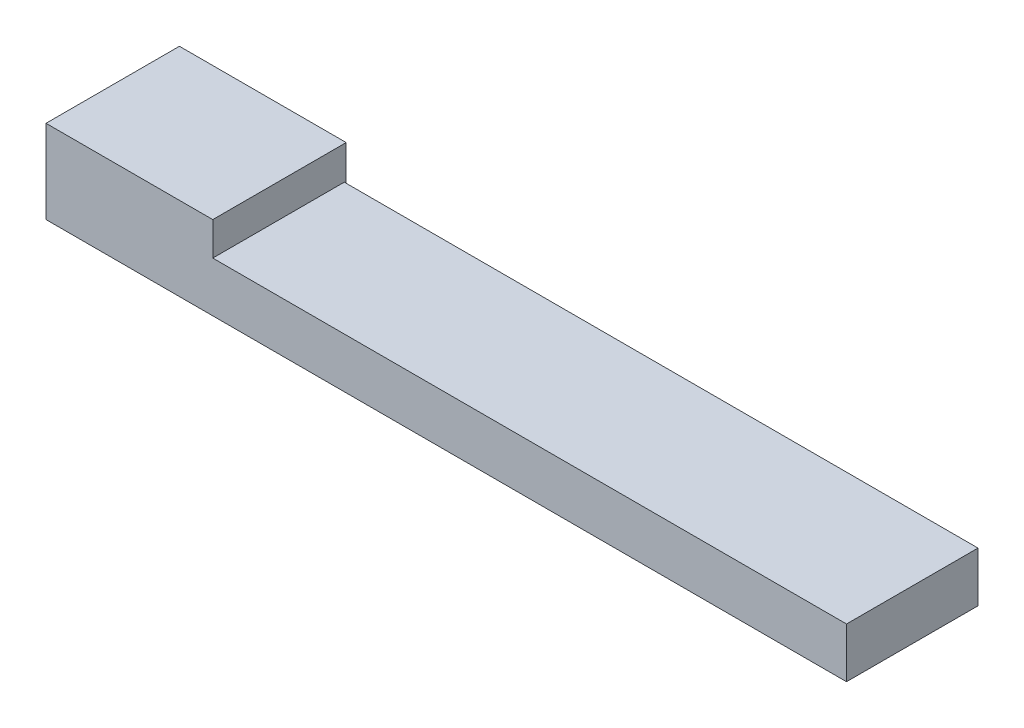
ISO-10303-21;
HEADER;
FILE_DESCRIPTION(('STEP AP214'),'2;1');
FILE_NAME('part.step','',(''),(''),'','','');
FILE_SCHEMA(('AUTOMOTIVE_DESIGN { 1 0 10303 214 1 1 1 1 }'));
ENDSEC;
DATA;
#1=APPLICATION_CONTEXT('core data for automotive mechanical design processes');
#2=APPLICATION_PROTOCOL_DEFINITION('international standard','automotive_design',2000,#1);
#3=PRODUCT_CONTEXT('',#1,'mechanical');
#4=PRODUCT('Part','Part','',(#3));
#5=PRODUCT_RELATED_PRODUCT_CATEGORY('part','',(#4));
#6=PRODUCT_DEFINITION_FORMATION('','',#4);
#7=PRODUCT_DEFINITION_CONTEXT('part definition',#1,'design');
#8=PRODUCT_DEFINITION('design','',#6,#7);
#9=PRODUCT_DEFINITION_SHAPE('','',#8);
#10=(LENGTH_UNIT() NAMED_UNIT(*) SI_UNIT(.MILLI.,.METRE.));
#11=(NAMED_UNIT(*) PLANE_ANGLE_UNIT() SI_UNIT($,.RADIAN.));
#12=(NAMED_UNIT(*) SI_UNIT($,.STERADIAN.) SOLID_ANGLE_UNIT());
#13=UNCERTAINTY_MEASURE_WITH_UNIT(LENGTH_MEASURE(1.E-05),#10,'distance_accuracy_value','');
#14=(GEOMETRIC_REPRESENTATION_CONTEXT(3) GLOBAL_UNCERTAINTY_ASSIGNED_CONTEXT((#13)) GLOBAL_UNIT_ASSIGNED_CONTEXT((#10,
#11,#12)) REPRESENTATION_CONTEXT('',''));
#15=CARTESIAN_POINT('',(0.,0.,0.));
#16=DIRECTION('',(0.,0.,1.));
#17=DIRECTION('',(1.,0.,0.));
#18=AXIS2_PLACEMENT_3D('',#15,#16,#17);
#19=CARTESIAN_POINT('',(-62.2244309443341,1524.,-2375.58992735266));
#20=DIRECTION('',(1.,0.,0.));
#21=DIRECTION('',(0.,0.,-1.));
#22=AXIS2_PLACEMENT_3D('',#19,#20,#21);
#23=PLANE('',#22);
#24=DIRECTION('',(0.,0.,1.));
#25=VECTOR('',#24,1.);
#26=CARTESIAN_POINT('',(-62.2244309443341,0.,-2375.58992735266));
#27=LINE('',#26,#25);
#28=CARTESIAN_POINT('',(-62.2244309443341,0.,-2375.58992735266));
#29=VERTEX_POINT('',#28);
#30=CARTESIAN_POINT('',(-62.2244309443338,0.,62.8100726473393));
#31=VERTEX_POINT('',#30);
#32=EDGE_CURVE('E133',#29,#31,#27,.T.);
#33=ORIENTED_EDGE('',*,*,#32,.T.);
#34=DIRECTION('',(0.,-1.,0.));
#35=VECTOR('',#34,1.);
#36=CARTESIAN_POINT('',(-62.2244309443338,1524.,62.8100726473393));
#37=LINE('',#36,#35);
#38=CARTESIAN_POINT('',(-62.2244309443338,1524.,62.8100726473393));
#39=VERTEX_POINT('',#38);
#40=EDGE_CURVE('E11',#39,#31,#37,.T.);
#41=ORIENTED_EDGE('',*,*,#40,.F.);
#42=DIRECTION('',(0.,0.,1.));
#43=VECTOR('',#42,1.);
#44=CARTESIAN_POINT('',(-62.2244309443341,1524.,-2375.58992735266));
#45=LINE('',#44,#43);
#46=CARTESIAN_POINT('',(-62.2244309443341,1524.,-2375.58992735266));
#47=VERTEX_POINT('',#46);
#48=EDGE_CURVE('E136',#47,#39,#45,.T.);
#49=ORIENTED_EDGE('',*,*,#48,.F.);
#50=DIRECTION('',(0.,-1.,0.));
#51=VECTOR('',#50,1.);
#52=CARTESIAN_POINT('',(-62.2244309443341,1524.,-2375.58992735266));
#53=LINE('',#52,#51);
#54=EDGE_CURVE('E142',#47,#29,#53,.T.);
#55=ORIENTED_EDGE('',*,*,#54,.T.);
#56=EDGE_LOOP('',(#33,#41,#49,#55));
#57=FACE_BOUND('',#56,.T.);
#58=ADVANCED_FACE('F30',(#57),#23,.F.);
#59=CARTESIAN_POINT('',(-62.2244309443338,1524.,62.8100726473393));
#60=DIRECTION('',(0.,0.,-1.));
#61=DIRECTION('',(-1.,0.,0.));
#62=AXIS2_PLACEMENT_3D('',#59,#60,#61);
#63=PLANE('',#62);
#64=DIRECTION('',(1.,0.,0.));
#65=VECTOR('',#64,1.);
#66=CARTESIAN_POINT('',(-62.2244309443338,0.,62.8100726473393));
#67=LINE('',#66,#65);
#68=CARTESIAN_POINT('',(14568.1755690557,0.,62.8100726473391));
#69=VERTEX_POINT('',#68);
#70=EDGE_CURVE('E145',#31,#69,#67,.T.);
#71=ORIENTED_EDGE('',*,*,#70,.T.);
#72=DIRECTION('',(0.,-1.,0.));
#73=VECTOR('',#72,1.);
#74=CARTESIAN_POINT('',(14568.1755690557,914.4,62.8100726473391));
#75=LINE('',#74,#73);
#76=CARTESIAN_POINT('',(14568.1755690557,914.4,62.8100726473391));
#77=VERTEX_POINT('',#76);
#78=EDGE_CURVE('E131',#77,#69,#75,.T.);
#79=ORIENTED_EDGE('',*,*,#78,.F.);
#80=DIRECTION('',(-1.,0.,0.));
#81=VECTOR('',#80,1.);
#82=CARTESIAN_POINT('',(2985.77556905567,914.4,62.8100726473391));
#83=LINE('',#82,#81);
#84=CARTESIAN_POINT('',(2985.77556905567,914.4,62.8100726473391));
#85=VERTEX_POINT('',#84);
#86=EDGE_CURVE('E105',#77,#85,#83,.T.);
#87=ORIENTED_EDGE('',*,*,#86,.T.);
#88=DIRECTION('',(0.,-1.,0.));
#89=VECTOR('',#88,1.);
#90=CARTESIAN_POINT('',(2985.77556905567,1524.,62.8100726473391));
#91=LINE('',#90,#89);
#92=CARTESIAN_POINT('',(2985.77556905567,1524.,62.8100726473391));
#93=VERTEX_POINT('',#92);
#94=EDGE_CURVE('E38',#93,#85,#91,.T.);
#95=ORIENTED_EDGE('',*,*,#94,.F.);
#96=DIRECTION('',(1.,0.,0.));
#97=VECTOR('',#96,1.);
#98=CARTESIAN_POINT('',(-62.2244309443338,1524.,62.8100726473393));
#99=LINE('',#98,#97);
#100=EDGE_CURVE('E80',#39,#93,#99,.T.);
#101=ORIENTED_EDGE('',*,*,#100,.F.);
#102=ORIENTED_EDGE('',*,*,#40,.T.);
#103=EDGE_LOOP('',(#71,#79,#87,#95,#101,#102));
#104=FACE_BOUND('',#103,.T.);
#105=ADVANCED_FACE('F165',(#104),#63,.F.);
#106=CARTESIAN_POINT('',(2985.77556905567,1524.,-2375.58992735266));
#107=DIRECTION('',(-1.,0.,0.));
#108=DIRECTION('',(0.,0.,1.));
#109=AXIS2_PLACEMENT_3D('',#106,#107,#108);
#110=PLANE('',#109);
#111=ORIENTED_EDGE('',*,*,#94,.T.);
#112=DIRECTION('',(0.,0.,-1.));
#113=VECTOR('',#112,1.);
#114=CARTESIAN_POINT('',(2985.77556905567,914.4,62.8100726473391));
#115=LINE('',#114,#113);
#116=CARTESIAN_POINT('',(2985.77556905567,914.4,-2340.28184953962));
#117=VERTEX_POINT('',#116);
#118=EDGE_CURVE('E111',#85,#117,#115,.T.);
#119=ORIENTED_EDGE('',*,*,#118,.T.);
#120=DIRECTION('',(0.,-1.,0.));
#121=VECTOR('',#120,1.);
#122=CARTESIAN_POINT('',(2985.77556905567,914.4,-2340.28184953962));
#123=LINE('',#122,#121);
#124=CARTESIAN_POINT('',(2985.77556905567,0.,-2340.28184953962));
#125=VERTEX_POINT('',#124);
#126=EDGE_CURVE('E97',#117,#125,#123,.T.);
#127=ORIENTED_EDGE('',*,*,#126,.T.);
#128=DIRECTION('',(0.,0.,-1.));
#129=VECTOR('',#128,1.);
#130=CARTESIAN_POINT('',(2985.77556905567,0.,-2375.58992735266));
#131=LINE('',#130,#129);
#132=CARTESIAN_POINT('',(2985.77556905567,0.,-2375.58992735266));
#133=VERTEX_POINT('',#132);
#134=EDGE_CURVE('E147',#125,#133,#131,.T.);
#135=ORIENTED_EDGE('',*,*,#134,.T.);
#136=DIRECTION('',(0.,-1.,0.));
#137=VECTOR('',#136,1.);
#138=CARTESIAN_POINT('',(2985.77556905567,1524.,-2375.58992735266));
#139=LINE('',#138,#137);
#140=CARTESIAN_POINT('',(2985.77556905567,1524.,-2375.58992735266));
#141=VERTEX_POINT('',#140);
#142=EDGE_CURVE('E155',#141,#133,#139,.T.);
#143=ORIENTED_EDGE('',*,*,#142,.F.);
#144=DIRECTION('',(0.,0.,-1.));
#145=VECTOR('',#144,1.);
#146=CARTESIAN_POINT('',(2985.77556905567,1524.,-2375.58992735266));
#147=LINE('',#146,#145);
#148=EDGE_CURVE('E139',#93,#141,#147,.T.);
#149=ORIENTED_EDGE('',*,*,#148,.F.);
#150=EDGE_LOOP('',(#111,#119,#127,#135,#143,#149));
#151=FACE_BOUND('',#150,.T.);
#152=ADVANCED_FACE('F117',(#151),#110,.F.);
#153=CARTESIAN_POINT('',(-62.2244309443341,1524.,-2375.58992735266));
#154=DIRECTION('',(0.,0.,1.));
#155=DIRECTION('',(1.,0.,0.));
#156=AXIS2_PLACEMENT_3D('',#153,#154,#155);
#157=PLANE('',#156);
#158=DIRECTION('',(-1.,0.,0.));
#159=VECTOR('',#158,1.);
#160=CARTESIAN_POINT('',(-62.2244309443341,0.,-2375.58992735266));
#161=LINE('',#160,#159);
#162=EDGE_CURVE('E73',#133,#29,#161,.T.);
#163=ORIENTED_EDGE('',*,*,#162,.T.);
#164=ORIENTED_EDGE('',*,*,#54,.F.);
#165=DIRECTION('',(-1.,0.,0.));
#166=VECTOR('',#165,1.);
#167=CARTESIAN_POINT('',(-62.2244309443341,1524.,-2375.58992735266));
#168=LINE('',#167,#166);
#169=EDGE_CURVE('E55',#141,#47,#168,.T.);
#170=ORIENTED_EDGE('',*,*,#169,.F.);
#171=ORIENTED_EDGE('',*,*,#142,.T.);
#172=EDGE_LOOP('',(#163,#164,#170,#171));
#173=FACE_BOUND('',#172,.T.);
#174=ADVANCED_FACE('F171',(#173),#157,.F.);
#175=CARTESIAN_POINT('',(-62.2244309443338,1524.,62.8100726473393));
#176=DIRECTION('',(0.,1.,0.));
#177=DIRECTION('',(0.,0.,1.));
#178=AXIS2_PLACEMENT_3D('',#175,#176,#177);
#179=PLANE('',#178);
#180=ORIENTED_EDGE('',*,*,#48,.T.);
#181=ORIENTED_EDGE('',*,*,#100,.T.);
#182=ORIENTED_EDGE('',*,*,#148,.T.);
#183=ORIENTED_EDGE('',*,*,#169,.T.);
#184=EDGE_LOOP('',(#180,#181,#182,#183));
#185=FACE_BOUND('',#184,.T.);
#186=ADVANCED_FACE('F176',(#185),#179,.T.);
#187=CARTESIAN_POINT('',(-62.2244309443338,0.,62.8100726473393));
#188=DIRECTION('',(0.,1.,0.));
#189=DIRECTION('',(0.,0.,1.));
#190=AXIS2_PLACEMENT_3D('',#187,#188,#189);
#191=PLANE('',#190);
#192=ORIENTED_EDGE('',*,*,#32,.F.);
#193=ORIENTED_EDGE('',*,*,#162,.F.);
#194=ORIENTED_EDGE('',*,*,#134,.F.);
#195=DIRECTION('',(1.,0.,0.));
#196=VECTOR('',#195,1.);
#197=CARTESIAN_POINT('',(2985.77556905567,0.,-2340.28184953962));
#198=LINE('',#197,#196);
#199=CARTESIAN_POINT('',(14568.1755690557,0.,-2340.28184953962));
#200=VERTEX_POINT('',#199);
#201=EDGE_CURVE('E46',#125,#200,#198,.T.);
#202=ORIENTED_EDGE('',*,*,#201,.T.);
#203=DIRECTION('',(0.,0.,1.));
#204=VECTOR('',#203,1.);
#205=CARTESIAN_POINT('',(14568.1755690557,0.,62.8100726473391));
#206=LINE('',#205,#204);
#207=EDGE_CURVE('E119',#200,#69,#206,.T.);
#208=ORIENTED_EDGE('',*,*,#207,.T.);
#209=ORIENTED_EDGE('',*,*,#70,.F.);
#210=EDGE_LOOP('',(#192,#193,#194,#202,#208,#209));
#211=FACE_BOUND('',#210,.T.);
#212=ADVANCED_FACE('F163',(#211),#191,.F.);
#213=CARTESIAN_POINT('',(14568.1755690557,914.4,62.8100726473391));
#214=DIRECTION('',(1.,0.,0.));
#215=DIRECTION('',(0.,0.,-1.));
#216=AXIS2_PLACEMENT_3D('',#213,#214,#215);
#217=PLANE('',#216);
#218=ORIENTED_EDGE('',*,*,#207,.F.);
#219=DIRECTION('',(0.,-1.,0.));
#220=VECTOR('',#219,1.);
#221=CARTESIAN_POINT('',(14568.1755690557,914.4,-2340.28184953962));
#222=LINE('',#221,#220);
#223=CARTESIAN_POINT('',(14568.1755690557,914.4,-2340.28184953962));
#224=VERTEX_POINT('',#223);
#225=EDGE_CURVE('E104',#224,#200,#222,.T.);
#226=ORIENTED_EDGE('',*,*,#225,.F.);
#227=DIRECTION('',(0.,0.,1.));
#228=VECTOR('',#227,1.);
#229=CARTESIAN_POINT('',(14568.1755690557,914.4,62.8100726473391));
#230=LINE('',#229,#228);
#231=EDGE_CURVE('E114',#224,#77,#230,.T.);
#232=ORIENTED_EDGE('',*,*,#231,.T.);
#233=ORIENTED_EDGE('',*,*,#78,.T.);
#234=EDGE_LOOP('',(#218,#226,#232,#233));
#235=FACE_BOUND('',#234,.T.);
#236=ADVANCED_FACE('F179',(#235),#217,.T.);
#237=CARTESIAN_POINT('',(2985.77556905567,914.4,-2340.28184953962));
#238=DIRECTION('',(0.,0.,-1.));
#239=DIRECTION('',(-1.,0.,0.));
#240=AXIS2_PLACEMENT_3D('',#237,#238,#239);
#241=PLANE('',#240);
#242=ORIENTED_EDGE('',*,*,#201,.F.);
#243=ORIENTED_EDGE('',*,*,#126,.F.);
#244=DIRECTION('',(1.,0.,0.));
#245=VECTOR('',#244,1.);
#246=CARTESIAN_POINT('',(2985.77556905567,914.4,-2340.28184953962));
#247=LINE('',#246,#245);
#248=EDGE_CURVE('E100',#117,#224,#247,.T.);
#249=ORIENTED_EDGE('',*,*,#248,.T.);
#250=ORIENTED_EDGE('',*,*,#225,.T.);
#251=EDGE_LOOP('',(#242,#243,#249,#250));
#252=FACE_BOUND('',#251,.T.);
#253=ADVANCED_FACE('F99',(#252),#241,.T.);
#254=CARTESIAN_POINT('',(2985.77556905567,914.4,-2340.28184953962));
#255=DIRECTION('',(0.,-1.,0.));
#256=DIRECTION('',(0.,0.,-1.));
#257=AXIS2_PLACEMENT_3D('',#254,#255,#256);
#258=PLANE('',#257);
#259=ORIENTED_EDGE('',*,*,#118,.F.);
#260=ORIENTED_EDGE('',*,*,#86,.F.);
#261=ORIENTED_EDGE('',*,*,#231,.F.);
#262=ORIENTED_EDGE('',*,*,#248,.F.);
#263=EDGE_LOOP('',(#259,#260,#261,#262));
#264=FACE_BOUND('',#263,.T.);
#265=ADVANCED_FACE('F109',(#264),#258,.F.);
#266=CLOSED_SHELL('',(#58,#105,#152,#174,#186,#212,#236,#253,#265));
#267=MANIFOLD_SOLID_BREP('B2',#266);
#268=ADVANCED_BREP_SHAPE_REPRESENTATION('',(#18,#267),#14);
#269=SHAPE_DEFINITION_REPRESENTATION(#9,#268);
ENDSEC;
END-ISO-10303-21;
